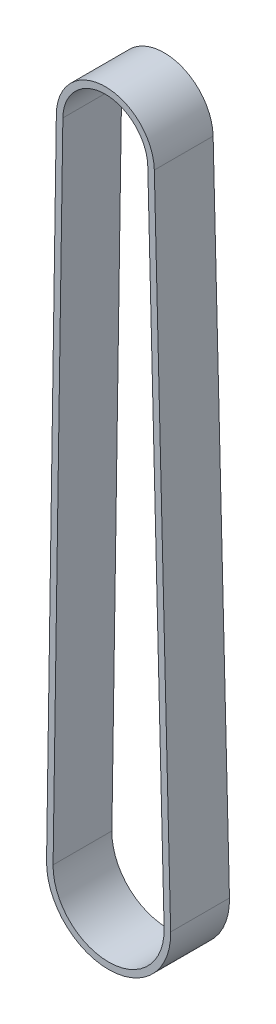
ISO-10303-21;
HEADER;
FILE_DESCRIPTION(('STEP AP214'),'2;1');
FILE_NAME('part.step','',(''),(''),'','','');
FILE_SCHEMA(('AUTOMOTIVE_DESIGN { 1 0 10303 214 1 1 1 1 }'));
ENDSEC;
DATA;
#1=APPLICATION_CONTEXT('core data for automotive mechanical design processes');
#2=APPLICATION_PROTOCOL_DEFINITION('international standard','automotive_design',2000,#1);
#3=PRODUCT_CONTEXT('',#1,'mechanical');
#4=PRODUCT('Part','Part','',(#3));
#5=PRODUCT_RELATED_PRODUCT_CATEGORY('part','',(#4));
#6=PRODUCT_DEFINITION_FORMATION('','',#4);
#7=PRODUCT_DEFINITION_CONTEXT('part definition',#1,'design');
#8=PRODUCT_DEFINITION('design','',#6,#7);
#9=PRODUCT_DEFINITION_SHAPE('','',#8);
#10=(LENGTH_UNIT() NAMED_UNIT(*) SI_UNIT(.MILLI.,.METRE.));
#11=(NAMED_UNIT(*) PLANE_ANGLE_UNIT() SI_UNIT($,.RADIAN.));
#12=(NAMED_UNIT(*) SI_UNIT($,.STERADIAN.) SOLID_ANGLE_UNIT());
#13=UNCERTAINTY_MEASURE_WITH_UNIT(LENGTH_MEASURE(1.E-05),#10,'distance_accuracy_value','');
#14=(GEOMETRIC_REPRESENTATION_CONTEXT(3) GLOBAL_UNCERTAINTY_ASSIGNED_CONTEXT((#13)) GLOBAL_UNIT_ASSIGNED_CONTEXT((#10,
#11,#12)) REPRESENTATION_CONTEXT('',''));
#15=CARTESIAN_POINT('',(0.,0.,0.));
#16=DIRECTION('',(0.,0.,1.));
#17=DIRECTION('',(1.,0.,0.));
#18=AXIS2_PLACEMENT_3D('',#15,#16,#17);
#19=CARTESIAN_POINT('',(4.64138172340256E-08,-7.85103534961529E-06,-7.));
#20=DIRECTION('',(0.,0.,1.));
#21=DIRECTION('',(1.,0.,0.));
#22=AXIS2_PLACEMENT_3D('',#19,#20,#21);
#23=CYLINDRICAL_SURFACE('',#22,7.5);
#24=CARTESIAN_POINT('',(4.64138172340256E-08,-7.85103534961529E-06,2.));
#25=DIRECTION('',(0.,0.,-1.));
#26=DIRECTION('',(-1.,0.,0.));
#27=AXIS2_PLACEMENT_3D('',#24,#25,#26);
#28=CIRCLE('',#27,7.5);
#29=CARTESIAN_POINT('',(7.49764634740212,0.187874945613104,2.));
#30=VERTEX_POINT('',#29);
#31=CARTESIAN_POINT('',(-7.49915253675666,0.112733154493116,2.));
#32=VERTEX_POINT('',#31);
#33=EDGE_CURVE('E155',#30,#32,#28,.F.);
#34=ORIENTED_EDGE('',*,*,#33,.F.);
#35=DIRECTION('',(0.,0.,1.));
#36=VECTOR('',#35,1.);
#37=CARTESIAN_POINT('',(7.49764634740212,0.187874945613104,-7.));
#38=LINE('',#37,#36);
#39=CARTESIAN_POINT('',(7.49764634740212,0.187874945613104,-7.));
#40=VERTEX_POINT('',#39);
#41=EDGE_CURVE('E12',#40,#30,#38,.T.);
#42=ORIENTED_EDGE('',*,*,#41,.F.);
#43=CARTESIAN_POINT('',(4.64138172340256E-08,-7.85103534961529E-06,-7.));
#44=DIRECTION('',(0.,0.,-1.));
#45=DIRECTION('',(-1.,0.,0.));
#46=AXIS2_PLACEMENT_3D('',#43,#44,#45);
#47=CIRCLE('',#46,7.5);
#48=CARTESIAN_POINT('',(-7.49915253675666,0.112733154493116,-7.));
#49=VERTEX_POINT('',#48);
#50=EDGE_CURVE('E159',#40,#49,#47,.F.);
#51=ORIENTED_EDGE('',*,*,#50,.T.);
#52=DIRECTION('',(0.,0.,1.));
#53=VECTOR('',#52,1.);
#54=CARTESIAN_POINT('',(-7.49915253675666,0.112733154493116,-7.));
#55=LINE('',#54,#53);
#56=EDGE_CURVE('E60',#49,#32,#55,.T.);
#57=ORIENTED_EDGE('',*,*,#56,.T.);
#58=EDGE_LOOP('',(#34,#42,#51,#57));
#59=FACE_BOUND('',#58,.T.);
#60=ADVANCED_FACE('F57',(#59),#23,.T.);
#61=CARTESIAN_POINT('',(7.49764634740212,0.187874945613104,-7.));
#62=DIRECTION('',(0.999686173465107,0.0250510395531272,0.));
#63=DIRECTION('',(-0.0250510395531272,0.999686173465107,0.));
#64=AXIS2_PLACEMENT_3D('',#61,#62,#63);
#65=PLANE('',#64);
#66=DIRECTION('',(-0.0250510395531272,0.999686173465107,0.));
#67=VECTOR('',#66,1.);
#68=CARTESIAN_POINT('',(7.49764634740212,0.187874945613104,2.));
#69=LINE('',#68,#67);
#70=CARTESIAN_POINT('',(9.99701864791119,-99.552015124086,2.));
#71=VERTEX_POINT('',#70);
#72=EDGE_CURVE('E163',#71,#30,#69,.T.);
#73=ORIENTED_EDGE('',*,*,#72,.F.);
#74=DIRECTION('',(0.,0.,1.));
#75=VECTOR('',#74,1.);
#76=CARTESIAN_POINT('',(9.99701864791119,-99.552015124086,-7.));
#77=LINE('',#76,#75);
#78=CARTESIAN_POINT('',(9.99701864791119,-99.552015124086,-7.));
#79=VERTEX_POINT('',#78);
#80=EDGE_CURVE('E65',#79,#71,#77,.T.);
#81=ORIENTED_EDGE('',*,*,#80,.F.);
#82=DIRECTION('',(-0.0250510395531272,0.999686173465107,0.));
#83=VECTOR('',#82,1.);
#84=CARTESIAN_POINT('',(7.49764634740212,0.187874945613104,-7.));
#85=LINE('',#84,#83);
#86=EDGE_CURVE('E169',#79,#40,#85,.T.);
#87=ORIENTED_EDGE('',*,*,#86,.T.);
#88=ORIENTED_EDGE('',*,*,#41,.T.);
#89=EDGE_LOOP('',(#73,#81,#87,#88));
#90=FACE_BOUND('',#89,.T.);
#91=ADVANCED_FACE('F195',(#90),#65,.T.);
#92=CARTESIAN_POINT('',(0.49999999999267,-99.7899999998407,-7.));
#93=DIRECTION('',(0.,0.,1.));
#94=DIRECTION('',(1.,0.,0.));
#95=AXIS2_PLACEMENT_3D('',#92,#93,#94);
#96=CYLINDRICAL_SURFACE('',#95,9.5);
#97=CARTESIAN_POINT('',(0.49999999999267,-99.7899999998407,2.));
#98=DIRECTION('',(0.,0.,-1.));
#99=DIRECTION('',(-1.,0.,0.));
#100=AXIS2_PLACEMENT_3D('',#97,#98,#99);
#101=CIRCLE('',#100,9.5);
#102=CARTESIAN_POINT('',(-8.9989266053566,-99.6471947261713,2.));
#103=VERTEX_POINT('',#102);
#104=EDGE_CURVE('E177',#103,#71,#101,.F.);
#105=ORIENTED_EDGE('',*,*,#104,.F.);
#106=DIRECTION('',(0.,0.,1.));
#107=VECTOR('',#106,1.);
#108=CARTESIAN_POINT('',(-8.9989266053566,-99.6471947261713,-7.));
#109=LINE('',#108,#107);
#110=CARTESIAN_POINT('',(-8.9989266053566,-99.6471947261713,-7.));
#111=VERTEX_POINT('',#110);
#112=EDGE_CURVE('E182',#111,#103,#109,.T.);
#113=ORIENTED_EDGE('',*,*,#112,.F.);
#114=CARTESIAN_POINT('',(0.49999999999267,-99.7899999998407,-7.));
#115=DIRECTION('',(0.,0.,-1.));
#116=DIRECTION('',(-1.,0.,0.));
#117=AXIS2_PLACEMENT_3D('',#114,#115,#116);
#118=CIRCLE('',#117,9.5);
#119=EDGE_CURVE('E166',#111,#79,#118,.F.);
#120=ORIENTED_EDGE('',*,*,#119,.T.);
#121=ORIENTED_EDGE('',*,*,#80,.T.);
#122=EDGE_LOOP('',(#105,#113,#120,#121));
#123=FACE_BOUND('',#122,.T.);
#124=ADVANCED_FACE('F199',(#123),#96,.T.);
#125=CARTESIAN_POINT('',(-7.49915253675666,0.112733154493116,-7.));
#126=DIRECTION('',(-0.999887011089397,0.0150321340704621,0.));
#127=DIRECTION('',(-0.0150321340704621,-0.999887011089397,0.));
#128=AXIS2_PLACEMENT_3D('',#125,#126,#127);
#129=PLANE('',#128);
#130=DIRECTION('',(-0.0150321340704621,-0.999887011089397,0.));
#131=VECTOR('',#130,1.);
#132=CARTESIAN_POINT('',(-7.49915253675666,0.112733154493116,2.));
#133=LINE('',#132,#131);
#134=EDGE_CURVE('E174',#32,#103,#133,.T.);
#135=ORIENTED_EDGE('',*,*,#134,.F.);
#136=ORIENTED_EDGE('',*,*,#56,.F.);
#137=DIRECTION('',(-0.0150321340704621,-0.999887011089397,0.));
#138=VECTOR('',#137,1.);
#139=CARTESIAN_POINT('',(-7.49915253675666,0.112733154493116,-7.));
#140=LINE('',#139,#138);
#141=EDGE_CURVE('E162',#49,#111,#140,.T.);
#142=ORIENTED_EDGE('',*,*,#141,.T.);
#143=ORIENTED_EDGE('',*,*,#112,.T.);
#144=EDGE_LOOP('',(#135,#136,#142,#143));
#145=FACE_BOUND('',#144,.T.);
#146=ADVANCED_FACE('F190',(#145),#129,.T.);
#147=CARTESIAN_POINT('',(4.64138172340256E-08,-7.85103534961529E-06,-7.));
#148=DIRECTION('',(0.,0.,-1.));
#149=DIRECTION('',(-1.,0.,0.));
#150=AXIS2_PLACEMENT_3D('',#147,#148,#149);
#151=PLANE('',#150);
#152=CARTESIAN_POINT('',(4.64138172340256E-08,-7.85103534961529E-06,-7.));
#153=DIRECTION('',(0.,0.,1.));
#154=DIRECTION('',(-1.,0.,0.));
#155=AXIS2_PLACEMENT_3D('',#152,#153,#154);
#156=CIRCLE('',#155,6.5);
#157=CARTESIAN_POINT('',(6.49796017393701,0.162823906059977,-7.));
#158=VERTEX_POINT('',#157);
#159=CARTESIAN_POINT('',(-6.49926552566726,0.0977010204226541,-7.));
#160=VERTEX_POINT('',#159);
#161=EDGE_CURVE('E124',#158,#160,#156,.T.);
#162=ORIENTED_EDGE('',*,*,#161,.T.);
#163=DIRECTION('',(-0.0150321340704621,-0.999887011089397,0.));
#164=VECTOR('',#163,1.);
#165=CARTESIAN_POINT('',(-7.9990395942672,-99.6622268602417,-7.));
#166=LINE('',#165,#164);
#167=CARTESIAN_POINT('',(-7.9990395942672,-99.6622268602418,-7.));
#168=VERTEX_POINT('',#167);
#169=EDGE_CURVE('E133',#160,#168,#166,.T.);
#170=ORIENTED_EDGE('',*,*,#169,.T.);
#171=CARTESIAN_POINT('',(0.49999999999267,-99.7899999998407,-7.));
#172=DIRECTION('',(0.,0.,1.));
#173=DIRECTION('',(-1.,0.,0.));
#174=AXIS2_PLACEMENT_3D('',#171,#172,#173);
#175=CIRCLE('',#174,8.5);
#176=CARTESIAN_POINT('',(8.99733247444608,-99.5770661636391,-7.));
#177=VERTEX_POINT('',#176);
#178=EDGE_CURVE('E73',#168,#177,#175,.T.);
#179=ORIENTED_EDGE('',*,*,#178,.T.);
#180=DIRECTION('',(-0.0250510395531272,0.999686173465107,0.));
#181=VECTOR('',#180,1.);
#182=CARTESIAN_POINT('',(6.49796017393701,0.162823906059977,-7.));
#183=LINE('',#182,#181);
#184=EDGE_CURVE('E130',#177,#158,#183,.T.);
#185=ORIENTED_EDGE('',*,*,#184,.T.);
#186=EDGE_LOOP('',(#162,#170,#179,#185));
#187=FACE_BOUND('',#186,.T.);
#188=ORIENTED_EDGE('',*,*,#50,.F.);
#189=ORIENTED_EDGE('',*,*,#86,.F.);
#190=ORIENTED_EDGE('',*,*,#119,.F.);
#191=ORIENTED_EDGE('',*,*,#141,.F.);
#192=EDGE_LOOP('',(#188,#189,#190,#191));
#193=FACE_BOUND('',#192,.T.);
#194=ADVANCED_FACE('F137',(#187,#193),#151,.T.);
#195=CARTESIAN_POINT('',(4.64138172340256E-08,-7.85103534961529E-06,2.));
#196=DIRECTION('',(0.,0.,-1.));
#197=DIRECTION('',(-1.,0.,0.));
#198=AXIS2_PLACEMENT_3D('',#195,#196,#197);
#199=PLANE('',#198);
#200=DIRECTION('',(-0.0150321340704621,-0.999887011089397,0.));
#201=VECTOR('',#200,1.);
#202=CARTESIAN_POINT('',(-7.9990395942672,-99.6622268602417,2.));
#203=LINE('',#202,#201);
#204=CARTESIAN_POINT('',(-6.49926552566726,0.0977010204226541,2.));
#205=VERTEX_POINT('',#204);
#206=CARTESIAN_POINT('',(-7.9990395942672,-99.6622268602417,2.));
#207=VERTEX_POINT('',#206);
#208=EDGE_CURVE('E149',#205,#207,#203,.T.);
#209=ORIENTED_EDGE('',*,*,#208,.F.);
#210=CARTESIAN_POINT('',(4.64138172340256E-08,-7.85103534961529E-06,2.));
#211=DIRECTION('',(0.,0.,1.));
#212=DIRECTION('',(-1.,0.,0.));
#213=AXIS2_PLACEMENT_3D('',#210,#211,#212);
#214=CIRCLE('',#213,6.5);
#215=CARTESIAN_POINT('',(6.49796017393701,0.162823906059977,2.));
#216=VERTEX_POINT('',#215);
#217=EDGE_CURVE('E81',#216,#205,#214,.T.);
#218=ORIENTED_EDGE('',*,*,#217,.F.);
#219=DIRECTION('',(-0.0250510395531272,0.999686173465107,0.));
#220=VECTOR('',#219,1.);
#221=CARTESIAN_POINT('',(6.49796017393701,0.162823906059977,2.));
#222=LINE('',#221,#220);
#223=CARTESIAN_POINT('',(8.99733247444608,-99.5770661636391,2.));
#224=VERTEX_POINT('',#223);
#225=EDGE_CURVE('E140',#224,#216,#222,.T.);
#226=ORIENTED_EDGE('',*,*,#225,.F.);
#227=CARTESIAN_POINT('',(0.49999999999267,-99.7899999998407,2.));
#228=DIRECTION('',(0.,0.,1.));
#229=DIRECTION('',(-1.,0.,0.));
#230=AXIS2_PLACEMENT_3D('',#227,#228,#229);
#231=CIRCLE('',#230,8.5);
#232=EDGE_CURVE('E143',#207,#224,#231,.T.);
#233=ORIENTED_EDGE('',*,*,#232,.F.);
#234=EDGE_LOOP('',(#209,#218,#226,#233));
#235=FACE_BOUND('',#234,.T.);
#236=ORIENTED_EDGE('',*,*,#33,.T.);
#237=ORIENTED_EDGE('',*,*,#134,.T.);
#238=ORIENTED_EDGE('',*,*,#104,.T.);
#239=ORIENTED_EDGE('',*,*,#72,.T.);
#240=EDGE_LOOP('',(#236,#237,#238,#239));
#241=FACE_BOUND('',#240,.T.);
#242=ADVANCED_FACE('F192',(#235,#241),#199,.F.);
#243=CARTESIAN_POINT('',(4.64138172340256E-08,-7.85103534961529E-06,-7.));
#244=DIRECTION('',(0.,0.,1.));
#245=DIRECTION('',(1.,0.,0.));
#246=AXIS2_PLACEMENT_3D('',#243,#244,#245);
#247=CYLINDRICAL_SURFACE('',#246,6.5);
#248=ORIENTED_EDGE('',*,*,#217,.T.);
#249=DIRECTION('',(0.,0.,1.));
#250=VECTOR('',#249,1.);
#251=CARTESIAN_POINT('',(-6.49926552566726,0.0977010204226541,-7.));
#252=LINE('',#251,#250);
#253=EDGE_CURVE('E120',#160,#205,#252,.T.);
#254=ORIENTED_EDGE('',*,*,#253,.F.);
#255=ORIENTED_EDGE('',*,*,#161,.F.);
#256=DIRECTION('',(0.,0.,1.));
#257=VECTOR('',#256,1.);
#258=CARTESIAN_POINT('',(6.49796017393701,0.162823906059977,-7.));
#259=LINE('',#258,#257);
#260=EDGE_CURVE('E153',#158,#216,#259,.T.);
#261=ORIENTED_EDGE('',*,*,#260,.T.);
#262=EDGE_LOOP('',(#248,#254,#255,#261));
#263=FACE_BOUND('',#262,.T.);
#264=ADVANCED_FACE('F122',(#263),#247,.F.);
#265=CARTESIAN_POINT('',(6.49796017393701,0.162823906059977,-7.));
#266=DIRECTION('',(0.999686173465107,0.0250510395531272,0.));
#267=DIRECTION('',(-0.0250510395531272,0.999686173465107,0.));
#268=AXIS2_PLACEMENT_3D('',#265,#266,#267);
#269=PLANE('',#268);
#270=ORIENTED_EDGE('',*,*,#225,.T.);
#271=ORIENTED_EDGE('',*,*,#260,.F.);
#272=ORIENTED_EDGE('',*,*,#184,.F.);
#273=DIRECTION('',(0.,0.,1.));
#274=VECTOR('',#273,1.);
#275=CARTESIAN_POINT('',(8.99733247444608,-99.5770661636391,-7.));
#276=LINE('',#275,#274);
#277=EDGE_CURVE('E156',#177,#224,#276,.T.);
#278=ORIENTED_EDGE('',*,*,#277,.T.);
#279=EDGE_LOOP('',(#270,#271,#272,#278));
#280=FACE_BOUND('',#279,.T.);
#281=ADVANCED_FACE('F250',(#280),#269,.F.);
#282=CARTESIAN_POINT('',(0.49999999999267,-99.7899999998407,-7.));
#283=DIRECTION('',(0.,0.,1.));
#284=DIRECTION('',(1.,0.,0.));
#285=AXIS2_PLACEMENT_3D('',#282,#283,#284);
#286=CYLINDRICAL_SURFACE('',#285,8.5);
#287=ORIENTED_EDGE('',*,*,#232,.T.);
#288=ORIENTED_EDGE('',*,*,#277,.F.);
#289=ORIENTED_EDGE('',*,*,#178,.F.);
#290=DIRECTION('',(0.,0.,1.));
#291=VECTOR('',#290,1.);
#292=CARTESIAN_POINT('',(-7.9990395942672,-99.6622268602417,-7.));
#293=LINE('',#292,#291);
#294=EDGE_CURVE('E129',#168,#207,#293,.T.);
#295=ORIENTED_EDGE('',*,*,#294,.T.);
#296=EDGE_LOOP('',(#287,#288,#289,#295));
#297=FACE_BOUND('',#296,.T.);
#298=ADVANCED_FACE('F259',(#297),#286,.F.);
#299=CARTESIAN_POINT('',(-7.9990395942672,-99.6622268602417,-7.));
#300=DIRECTION('',(-0.999887011089397,0.0150321340704621,0.));
#301=DIRECTION('',(-0.0150321340704621,-0.999887011089397,0.));
#302=AXIS2_PLACEMENT_3D('',#299,#300,#301);
#303=PLANE('',#302);
#304=ORIENTED_EDGE('',*,*,#208,.T.);
#305=ORIENTED_EDGE('',*,*,#294,.F.);
#306=ORIENTED_EDGE('',*,*,#169,.F.);
#307=ORIENTED_EDGE('',*,*,#253,.T.);
#308=EDGE_LOOP('',(#304,#305,#306,#307));
#309=FACE_BOUND('',#308,.T.);
#310=ADVANCED_FACE('F134',(#309),#303,.F.);
#311=CLOSED_SHELL('',(#60,#91,#124,#146,#194,#242,#264,#281,#298,#310));
#312=MANIFOLD_SOLID_BREP('B2',#311);
#313=ADVANCED_BREP_SHAPE_REPRESENTATION('',(#18,#312),#14);
#314=SHAPE_DEFINITION_REPRESENTATION(#9,#313);
ENDSEC;
END-ISO-10303-21;
